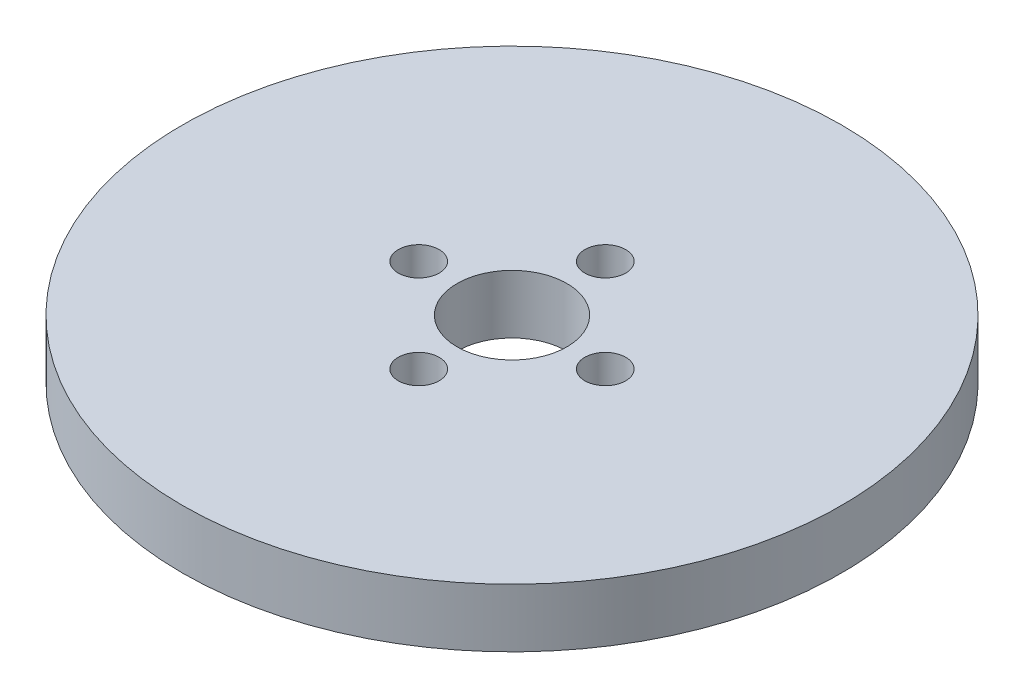
ISO-10303-21;
HEADER;
FILE_DESCRIPTION(('STEP AP214'),'2;1');
FILE_NAME('part.step','',(''),(''),'','','');
FILE_SCHEMA(('AUTOMOTIVE_DESIGN { 1 0 10303 214 1 1 1 1 }'));
ENDSEC;
DATA;
#1=APPLICATION_CONTEXT('core data for automotive mechanical design processes');
#2=APPLICATION_PROTOCOL_DEFINITION('international standard','automotive_design',2000,#1);
#3=PRODUCT_CONTEXT('',#1,'mechanical');
#4=PRODUCT('Part','Part','',(#3));
#5=PRODUCT_RELATED_PRODUCT_CATEGORY('part','',(#4));
#6=PRODUCT_DEFINITION_FORMATION('','',#4);
#7=PRODUCT_DEFINITION_CONTEXT('part definition',#1,'design');
#8=PRODUCT_DEFINITION('design','',#6,#7);
#9=PRODUCT_DEFINITION_SHAPE('','',#8);
#10=(LENGTH_UNIT() NAMED_UNIT(*) SI_UNIT(.MILLI.,.METRE.));
#11=(NAMED_UNIT(*) PLANE_ANGLE_UNIT() SI_UNIT($,.RADIAN.));
#12=(NAMED_UNIT(*) SI_UNIT($,.STERADIAN.) SOLID_ANGLE_UNIT());
#13=UNCERTAINTY_MEASURE_WITH_UNIT(LENGTH_MEASURE(1.E-05),#10,'distance_accuracy_value','');
#14=(GEOMETRIC_REPRESENTATION_CONTEXT(3) GLOBAL_UNCERTAINTY_ASSIGNED_CONTEXT((#13)) GLOBAL_UNIT_ASSIGNED_CONTEXT((#10,
#11,#12)) REPRESENTATION_CONTEXT('',''));
#15=CARTESIAN_POINT('',(0.,0.,0.));
#16=DIRECTION('',(0.,0.,1.));
#17=DIRECTION('',(1.,0.,0.));
#18=AXIS2_PLACEMENT_3D('',#15,#16,#17);
#19=CARTESIAN_POINT('',(0.,8.,0.));
#20=DIRECTION('',(0.,-1.,0.));
#21=DIRECTION('',(0.,0.,-1.));
#22=AXIS2_PLACEMENT_3D('',#19,#20,#21);
#23=CYLINDRICAL_SURFACE('',#22,45.);
#24=CARTESIAN_POINT('',(0.,8.,0.));
#25=DIRECTION('',(0.,1.,0.));
#26=DIRECTION('',(0.,0.,1.));
#27=AXIS2_PLACEMENT_3D('',#24,#25,#26);
#28=CIRCLE('',#27,45.);
#29=CARTESIAN_POINT('',(0.,8.,45.));
#30=VERTEX_POINT('',#29);
#31=EDGE_CURVE('E10',#30,#30,#28,.T.);
#32=ORIENTED_EDGE('',*,*,#31,.F.);
#33=EDGE_LOOP('',(#32));
#34=FACE_BOUND('',#33,.T.);
#35=CARTESIAN_POINT('',(0.,0.,0.));
#36=DIRECTION('',(0.,1.,0.));
#37=DIRECTION('',(0.,0.,1.));
#38=AXIS2_PLACEMENT_3D('',#35,#36,#37);
#39=CIRCLE('',#38,45.);
#40=CARTESIAN_POINT('',(0.,0.,45.));
#41=VERTEX_POINT('',#40);
#42=EDGE_CURVE('E37',#41,#41,#39,.T.);
#43=ORIENTED_EDGE('',*,*,#42,.T.);
#44=EDGE_LOOP('',(#43));
#45=FACE_BOUND('',#44,.T.);
#46=ADVANCED_FACE('F40',(#34,#45),#23,.T.);
#47=CARTESIAN_POINT('',(0.,8.,0.));
#48=DIRECTION('',(0.,1.,0.));
#49=DIRECTION('',(0.,0.,1.));
#50=AXIS2_PLACEMENT_3D('',#47,#48,#49);
#51=PLANE('',#50);
#52=CARTESIAN_POINT('',(0.,8.,12.7362660091459));
#53=DIRECTION('',(0.,1.,0.));
#54=DIRECTION('',(1.,0.,0.));
#55=AXIS2_PLACEMENT_3D('',#52,#53,#54);
#56=CIRCLE('',#55,2.78975216788166);
#57=CARTESIAN_POINT('',(0.,8.,15.5260181770275));
#58=VERTEX_POINT('',#57);
#59=EDGE_CURVE('E71',#58,#58,#56,.T.);
#60=ORIENTED_EDGE('',*,*,#59,.F.);
#61=EDGE_LOOP('',(#60));
#62=FACE_BOUND('',#61,.T.);
#63=CARTESIAN_POINT('',(12.7362660091459,8.,0.));
#64=DIRECTION('',(0.,1.,0.));
#65=DIRECTION('',(0.,0.,-1.));
#66=AXIS2_PLACEMENT_3D('',#63,#64,#65);
#67=CIRCLE('',#66,2.78975216788166);
#68=CARTESIAN_POINT('',(12.7362660091459,8.,2.78975216788166));
#69=VERTEX_POINT('',#68);
#70=EDGE_CURVE('E70',#69,#69,#67,.T.);
#71=ORIENTED_EDGE('',*,*,#70,.F.);
#72=EDGE_LOOP('',(#71));
#73=FACE_BOUND('',#72,.T.);
#74=CARTESIAN_POINT('',(-1.33405305292425E-13,8.,-12.7362660091459));
#75=DIRECTION('',(0.,1.,0.));
#76=DIRECTION('',(-1.,0.,0.));
#77=AXIS2_PLACEMENT_3D('',#74,#75,#76);
#78=CIRCLE('',#77,2.78975216788166);
#79=CARTESIAN_POINT('',(-1.33405305292425E-13,8.,-9.94651384126422));
#80=VERTEX_POINT('',#79);
#81=EDGE_CURVE('E61',#80,#80,#78,.T.);
#82=ORIENTED_EDGE('',*,*,#81,.F.);
#83=EDGE_LOOP('',(#82));
#84=FACE_BOUND('',#83,.T.);
#85=CARTESIAN_POINT('',(-12.7362660091459,8.,0.));
#86=DIRECTION('',(0.,1.,0.));
#87=DIRECTION('',(0.,0.,1.));
#88=AXIS2_PLACEMENT_3D('',#85,#86,#87);
#89=CIRCLE('',#88,2.78975216788166);
#90=CARTESIAN_POINT('',(-12.7362660091459,8.,2.78975216788166));
#91=VERTEX_POINT('',#90);
#92=EDGE_CURVE('E54',#91,#91,#89,.T.);
#93=ORIENTED_EDGE('',*,*,#92,.F.);
#94=EDGE_LOOP('',(#93));
#95=FACE_BOUND('',#94,.T.);
#96=CARTESIAN_POINT('',(0.,8.,0.));
#97=DIRECTION('',(0.,1.,0.));
#98=DIRECTION('',(0.,0.,1.));
#99=AXIS2_PLACEMENT_3D('',#96,#97,#98);
#100=CIRCLE('',#99,7.5);
#101=CARTESIAN_POINT('',(0.,8.,7.5));
#102=VERTEX_POINT('',#101);
#103=EDGE_CURVE('E50',#102,#102,#100,.T.);
#104=ORIENTED_EDGE('',*,*,#103,.F.);
#105=EDGE_LOOP('',(#104));
#106=FACE_BOUND('',#105,.T.);
#107=ORIENTED_EDGE('',*,*,#31,.T.);
#108=EDGE_LOOP('',(#107));
#109=FACE_BOUND('',#108,.T.);
#110=ADVANCED_FACE('F86',(#62,#73,#84,#95,#106,#109),#51,.T.);
#111=CARTESIAN_POINT('',(0.,0.,0.));
#112=DIRECTION('',(0.,1.,0.));
#113=DIRECTION('',(0.,0.,1.));
#114=AXIS2_PLACEMENT_3D('',#111,#112,#113);
#115=PLANE('',#114);
#116=CARTESIAN_POINT('',(0.,0.,0.));
#117=DIRECTION('',(0.,1.,0.));
#118=DIRECTION('',(0.,0.,1.));
#119=AXIS2_PLACEMENT_3D('',#116,#117,#118);
#120=CIRCLE('',#119,7.5);
#121=CARTESIAN_POINT('',(0.,0.,7.5));
#122=VERTEX_POINT('',#121);
#123=EDGE_CURVE('E47',#122,#122,#120,.T.);
#124=ORIENTED_EDGE('',*,*,#123,.T.);
#125=EDGE_LOOP('',(#124));
#126=FACE_BOUND('',#125,.T.);
#127=ORIENTED_EDGE('',*,*,#42,.F.);
#128=EDGE_LOOP('',(#127));
#129=FACE_BOUND('',#128,.T.);
#130=ADVANCED_FACE('F93',(#126,#129),#115,.F.);
#131=CARTESIAN_POINT('',(0.,8.,0.));
#132=DIRECTION('',(0.,-1.,0.));
#133=DIRECTION('',(0.,0.,-1.));
#134=AXIS2_PLACEMENT_3D('',#131,#132,#133);
#135=CYLINDRICAL_SURFACE('',#134,7.5);
#136=ORIENTED_EDGE('',*,*,#103,.T.);
#137=EDGE_LOOP('',(#136));
#138=FACE_BOUND('',#137,.T.);
#139=ORIENTED_EDGE('',*,*,#123,.F.);
#140=EDGE_LOOP('',(#139));
#141=FACE_BOUND('',#140,.T.);
#142=ADVANCED_FACE('F101',(#138,#141),#135,.F.);
#143=CARTESIAN_POINT('',(-12.7362660091459,2.96052295465424,0.));
#144=DIRECTION('',(0.,1.,0.));
#145=DIRECTION('',(0.,0.,1.));
#146=AXIS2_PLACEMENT_3D('',#143,#144,#145);
#147=CYLINDRICAL_SURFACE('',#146,2.78975216788166);
#148=CARTESIAN_POINT('',(-12.7362660091459,2.96052295465424,0.));
#149=DIRECTION('',(0.,1.,0.));
#150=DIRECTION('',(0.,0.,1.));
#151=AXIS2_PLACEMENT_3D('',#148,#149,#150);
#152=CIRCLE('',#151,2.78975216788166);
#153=CARTESIAN_POINT('',(-12.7362660091459,2.96052295465424,2.78975216788166));
#154=VERTEX_POINT('',#153);
#155=EDGE_CURVE('E55',#154,#154,#152,.T.);
#156=CARTESIAN_POINT('',(-12.7362660091459,2.96052295465424,2.78975216788166));
#157=CARTESIAN_POINT('',(-12.7362660091459,3.01301750720992,2.78975216788166));
#158=CARTESIAN_POINT('',(-12.7362660091459,3.06551205976561,2.78975216788166));
#159=CARTESIAN_POINT('',(-12.7362660091459,3.17050116487698,2.78975216788166));
#160=CARTESIAN_POINT('',(-12.7362660091459,3.22299571743266,2.78975216788166));
#161=CARTESIAN_POINT('',(-12.7362660091459,3.32798482254403,2.78975216788166));
#162=CARTESIAN_POINT('',(-12.7362660091459,3.38047937509972,2.78975216788166));
#163=CARTESIAN_POINT('',(-12.7362660091459,3.48546848021109,2.78975216788166));
#164=CARTESIAN_POINT('',(-12.7362660091459,3.53796303276677,2.78975216788166));
#165=CARTESIAN_POINT('',(-12.7362660091459,3.64295213787814,2.78975216788166));
#166=CARTESIAN_POINT('',(-12.7362660091459,3.69544669043383,2.78975216788166));
#167=CARTESIAN_POINT('',(-12.7362660091459,3.8004357955452,2.78975216788166));
#168=CARTESIAN_POINT('',(-12.7362660091459,3.85293034810088,2.78975216788166));
#169=CARTESIAN_POINT('',(-12.7362660091459,3.95791945321225,2.78975216788166));
#170=CARTESIAN_POINT('',(-12.7362660091459,4.01041400576794,2.78975216788166));
#171=CARTESIAN_POINT('',(-12.7362660091459,4.11540311087931,2.78975216788166));
#172=CARTESIAN_POINT('',(-12.7362660091459,4.16789766343499,2.78975216788166));
#173=CARTESIAN_POINT('',(-12.7362660091459,4.27288676854636,2.78975216788166));
#174=CARTESIAN_POINT('',(-12.7362660091459,4.32538132110205,2.78975216788166));
#175=CARTESIAN_POINT('',(-12.7362660091459,4.43037042621342,2.78975216788166));
#176=CARTESIAN_POINT('',(-12.7362660091459,4.4828649787691,2.78975216788166));
#177=CARTESIAN_POINT('',(-12.7362660091459,4.58785408388047,2.78975216788166));
#178=CARTESIAN_POINT('',(-12.7362660091459,4.64034863643616,2.78975216788166));
#179=CARTESIAN_POINT('',(-12.7362660091459,4.74533774154753,2.78975216788166));
#180=CARTESIAN_POINT('',(-12.7362660091459,4.79783229410321,2.78975216788166));
#181=CARTESIAN_POINT('',(-12.7362660091459,4.90282139921458,2.78975216788166));
#182=CARTESIAN_POINT('',(-12.7362660091459,4.95531595177027,2.78975216788166));
#183=CARTESIAN_POINT('',(-12.7362660091459,5.06030505688164,2.78975216788166));
#184=CARTESIAN_POINT('',(-12.7362660091459,5.11279960943732,2.78975216788166));
#185=CARTESIAN_POINT('',(-12.7362660091459,5.21778871454869,2.78975216788166));
#186=CARTESIAN_POINT('',(-12.7362660091459,5.27028326710438,2.78975216788166));
#187=CARTESIAN_POINT('',(-12.7362660091459,5.37527237221575,2.78975216788166));
#188=CARTESIAN_POINT('',(-12.7362660091459,5.42776692477143,2.78975216788166));
#189=CARTESIAN_POINT('',(-12.7362660091459,5.5327560298828,2.78975216788166));
#190=CARTESIAN_POINT('',(-12.7362660091459,5.58525058243849,2.78975216788166));
#191=CARTESIAN_POINT('',(-12.7362660091459,5.69023968754986,2.78975216788166));
#192=CARTESIAN_POINT('',(-12.7362660091459,5.74273424010554,2.78975216788166));
#193=CARTESIAN_POINT('',(-12.7362660091459,5.84772334521691,2.78975216788166));
#194=CARTESIAN_POINT('',(-12.7362660091459,5.9002178977726,2.78975216788166));
#195=CARTESIAN_POINT('',(-12.7362660091459,6.00520700288397,2.78975216788166));
#196=CARTESIAN_POINT('',(-12.7362660091459,6.05770155543965,2.78975216788166));
#197=CARTESIAN_POINT('',(-12.7362660091459,6.16269066055102,2.78975216788166));
#198=CARTESIAN_POINT('',(-12.7362660091459,6.21518521310671,2.78975216788166));
#199=CARTESIAN_POINT('',(-12.7362660091459,6.32017431821808,2.78975216788166));
#200=CARTESIAN_POINT('',(-12.7362660091459,6.37266887077376,2.78975216788166));
#201=CARTESIAN_POINT('',(-12.7362660091459,6.47765797588513,2.78975216788166));
#202=CARTESIAN_POINT('',(-12.7362660091459,6.53015252844082,2.78975216788166));
#203=CARTESIAN_POINT('',(-12.7362660091459,6.63514163355219,2.78975216788166));
#204=CARTESIAN_POINT('',(-12.7362660091459,6.68763618610787,2.78975216788166));
#205=CARTESIAN_POINT('',(-12.7362660091459,6.79262529121924,2.78975216788166));
#206=CARTESIAN_POINT('',(-12.7362660091459,6.84511984377493,2.78975216788166));
#207=CARTESIAN_POINT('',(-12.7362660091459,6.9501089488863,2.78975216788166));
#208=CARTESIAN_POINT('',(-12.7362660091459,7.00260350144198,2.78975216788166));
#209=CARTESIAN_POINT('',(-12.7362660091459,7.10759260655335,2.78975216788166));
#210=CARTESIAN_POINT('',(-12.7362660091459,7.16008715910904,2.78975216788166));
#211=CARTESIAN_POINT('',(-12.7362660091459,7.26507626422041,2.78975216788166));
#212=CARTESIAN_POINT('',(-12.7362660091459,7.31757081677609,2.78975216788166));
#213=CARTESIAN_POINT('',(-12.7362660091459,7.42255992188746,2.78975216788166));
#214=CARTESIAN_POINT('',(-12.7362660091459,7.47505447444315,2.78975216788166));
#215=CARTESIAN_POINT('',(-12.7362660091459,7.58004357955452,2.78975216788166));
#216=CARTESIAN_POINT('',(-12.7362660091459,7.6325381321102,2.78975216788166));
#217=CARTESIAN_POINT('',(-12.7362660091459,7.73752723722157,2.78975216788166));
#218=CARTESIAN_POINT('',(-12.7362660091459,7.79002178977726,2.78975216788166));
#219=CARTESIAN_POINT('',(-12.7362660091459,7.89501089488863,2.78975216788166));
#220=CARTESIAN_POINT('',(-12.7362660091459,7.94750544744431,2.78975216788166));
#221=CARTESIAN_POINT('',(-12.7362660091459,8.,2.78975216788166));
#222=B_SPLINE_CURVE_WITH_KNOTS('',3,(#156,#157,#158,#159,#160,#161,#162,#163,#164,#165,#166,
#167,#168,#169,#170,#171,#172,#173,#174,#175,#176,#177,#178,#179,#180,#181,#182,#183,#184,#185,
#186,#187,#188,#189,#190,#191,#192,#193,#194,#195,#196,#197,#198,#199,#200,#201,#202,#203,#204,
#205,#206,#207,#208,#209,#210,#211,#212,#213,#214,#215,#216,#217,#218,#219,#220,#221),
.UNSPECIFIED.,.F.,.F.,(4,2,2,2,2,2,2,2,2,2,2,2,2,2,2,2,2,2,2,2,2,2,2,2,2,2,2,2,2,2,2,2,4),(0.,
0.157483657667055,0.31496731533411,0.472450973001165,0.62993463066822,0.787418288335275,
0.94490194600233,1.10238560366939,1.25986926133644,1.4173529190035,1.57483657667055,
1.73232023433761,1.88980389200466,2.04728754967172,2.20477120733877,2.36225486500583,
2.51973852267288,2.67722218033994,2.83470583800699,2.99218949567405,3.1496731533411,
3.30715681100816,3.46464046867521,3.62212412634227,3.77960778400932,3.93709144167638,
4.09457509934343,4.25205875701049,4.40954241467754,4.5670260723446,4.72450973001165,
4.88199338767871,5.03947704534576),.UNSPECIFIED.);
#223=EDGE_CURVE('BSEAM102',#154,#91,#222,.T.);
#224=ORIENTED_EDGE('',*,*,#155,.F.);
#225=ORIENTED_EDGE('',*,*,#92,.T.);
#226=ORIENTED_EDGE('',*,*,#223,.T.);
#227=ORIENTED_EDGE('',*,*,#223,.F.);
#228=EDGE_LOOP('',(#224,#226,#225,#227));
#229=FACE_BOUND('',#228,.T.);
#230=ADVANCED_FACE('F102',(#229),#147,.F.);
#231=CARTESIAN_POINT('',(-12.7362660091459,2.96052295465424,0.));
#232=DIRECTION('',(0.,1.,0.));
#233=DIRECTION('',(0.,0.,1.));
#234=AXIS2_PLACEMENT_3D('',#231,#232,#233);
#235=PLANE('',#234);
#236=ORIENTED_EDGE('',*,*,#155,.T.);
#237=EDGE_LOOP('',(#236));
#238=FACE_BOUND('',#237,.T.);
#239=ADVANCED_FACE('F133',(#238),#235,.T.);
#240=CARTESIAN_POINT('',(-1.33405305292425E-13,2.96052295465424,-12.7362660091459));
#241=DIRECTION('',(0.,1.,0.));
#242=DIRECTION('',(0.,0.,1.));
#243=AXIS2_PLACEMENT_3D('',#240,#241,#242);
#244=CYLINDRICAL_SURFACE('',#243,2.78975216788166);
#245=CARTESIAN_POINT('',(-1.33405305292425E-13,2.96052295465424,-12.7362660091459));
#246=DIRECTION('',(0.,1.,0.));
#247=DIRECTION('',(-1.,0.,0.));
#248=AXIS2_PLACEMENT_3D('',#245,#246,#247);
#249=CIRCLE('',#248,2.78975216788166);
#250=CARTESIAN_POINT('',(-1.33405305292425E-13,2.96052295465424,-9.94651384126422));
#251=VERTEX_POINT('',#250);
#252=EDGE_CURVE('E63',#251,#251,#249,.T.);
#253=CARTESIAN_POINT('',(-1.33405305292425E-13,2.96052295465424,-9.94651384126422));
#254=CARTESIAN_POINT('',(-1.33405305292425E-13,3.01301750720992,-9.94651384126422));
#255=CARTESIAN_POINT('',(-1.33405305292425E-13,3.06551205976561,-9.94651384126422));
#256=CARTESIAN_POINT('',(-1.33405305292425E-13,3.17050116487698,-9.94651384126422));
#257=CARTESIAN_POINT('',(-1.33405305292425E-13,3.22299571743266,-9.94651384126422));
#258=CARTESIAN_POINT('',(-1.33405305292425E-13,3.32798482254403,-9.94651384126422));
#259=CARTESIAN_POINT('',(-1.33405305292425E-13,3.38047937509972,-9.94651384126422));
#260=CARTESIAN_POINT('',(-1.33405305292425E-13,3.48546848021109,-9.94651384126422));
#261=CARTESIAN_POINT('',(-1.33405305292425E-13,3.53796303276677,-9.94651384126422));
#262=CARTESIAN_POINT('',(-1.33405305292425E-13,3.64295213787814,-9.94651384126422));
#263=CARTESIAN_POINT('',(-1.33405305292425E-13,3.69544669043383,-9.94651384126422));
#264=CARTESIAN_POINT('',(-1.33405305292425E-13,3.8004357955452,-9.94651384126422));
#265=CARTESIAN_POINT('',(-1.33405305292425E-13,3.85293034810088,-9.94651384126422));
#266=CARTESIAN_POINT('',(-1.33405305292425E-13,3.95791945321225,-9.94651384126422));
#267=CARTESIAN_POINT('',(-1.33405305292425E-13,4.01041400576794,-9.94651384126422));
#268=CARTESIAN_POINT('',(-1.33405305292425E-13,4.11540311087931,-9.94651384126422));
#269=CARTESIAN_POINT('',(-1.33405305292425E-13,4.16789766343499,-9.94651384126422));
#270=CARTESIAN_POINT('',(-1.33405305292425E-13,4.27288676854636,-9.94651384126422));
#271=CARTESIAN_POINT('',(-1.33405305292425E-13,4.32538132110205,-9.94651384126422));
#272=CARTESIAN_POINT('',(-1.33405305292425E-13,4.43037042621342,-9.94651384126422));
#273=CARTESIAN_POINT('',(-1.33405305292425E-13,4.4828649787691,-9.94651384126422));
#274=CARTESIAN_POINT('',(-1.33405305292425E-13,4.58785408388047,-9.94651384126422));
#275=CARTESIAN_POINT('',(-1.33405305292425E-13,4.64034863643616,-9.94651384126422));
#276=CARTESIAN_POINT('',(-1.33405305292425E-13,4.74533774154753,-9.94651384126422));
#277=CARTESIAN_POINT('',(-1.33405305292425E-13,4.79783229410321,-9.94651384126422));
#278=CARTESIAN_POINT('',(-1.33405305292425E-13,4.90282139921458,-9.94651384126422));
#279=CARTESIAN_POINT('',(-1.33405305292425E-13,4.95531595177027,-9.94651384126422));
#280=CARTESIAN_POINT('',(-1.33405305292425E-13,5.06030505688164,-9.94651384126422));
#281=CARTESIAN_POINT('',(-1.33405305292425E-13,5.11279960943732,-9.94651384126422));
#282=CARTESIAN_POINT('',(-1.33405305292425E-13,5.21778871454869,-9.94651384126422));
#283=CARTESIAN_POINT('',(-1.33405305292425E-13,5.27028326710438,-9.94651384126422));
#284=CARTESIAN_POINT('',(-1.33405305292425E-13,5.37527237221575,-9.94651384126422));
#285=CARTESIAN_POINT('',(-1.33405305292425E-13,5.42776692477143,-9.94651384126422));
#286=CARTESIAN_POINT('',(-1.33405305292425E-13,5.5327560298828,-9.94651384126422));
#287=CARTESIAN_POINT('',(-1.33405305292425E-13,5.58525058243849,-9.94651384126422));
#288=CARTESIAN_POINT('',(-1.33405305292425E-13,5.69023968754986,-9.94651384126422));
#289=CARTESIAN_POINT('',(-1.33405305292425E-13,5.74273424010554,-9.94651384126422));
#290=CARTESIAN_POINT('',(-1.33405305292425E-13,5.84772334521691,-9.94651384126422));
#291=CARTESIAN_POINT('',(-1.33405305292425E-13,5.9002178977726,-9.94651384126422));
#292=CARTESIAN_POINT('',(-1.33405305292425E-13,6.00520700288397,-9.94651384126422));
#293=CARTESIAN_POINT('',(-1.33405305292425E-13,6.05770155543965,-9.94651384126422));
#294=CARTESIAN_POINT('',(-1.33405305292425E-13,6.16269066055102,-9.94651384126422));
#295=CARTESIAN_POINT('',(-1.33405305292425E-13,6.21518521310671,-9.94651384126422));
#296=CARTESIAN_POINT('',(-1.33405305292425E-13,6.32017431821808,-9.94651384126422));
#297=CARTESIAN_POINT('',(-1.33405305292425E-13,6.37266887077376,-9.94651384126422));
#298=CARTESIAN_POINT('',(-1.33405305292425E-13,6.47765797588513,-9.94651384126422));
#299=CARTESIAN_POINT('',(-1.33405305292425E-13,6.53015252844082,-9.94651384126422));
#300=CARTESIAN_POINT('',(-1.33405305292425E-13,6.63514163355219,-9.94651384126422));
#301=CARTESIAN_POINT('',(-1.33405305292425E-13,6.68763618610787,-9.94651384126422));
#302=CARTESIAN_POINT('',(-1.33405305292425E-13,6.79262529121924,-9.94651384126422));
#303=CARTESIAN_POINT('',(-1.33405305292425E-13,6.84511984377493,-9.94651384126422));
#304=CARTESIAN_POINT('',(-1.33405305292425E-13,6.9501089488863,-9.94651384126422));
#305=CARTESIAN_POINT('',(-1.33405305292425E-13,7.00260350144198,-9.94651384126422));
#306=CARTESIAN_POINT('',(-1.33405305292425E-13,7.10759260655335,-9.94651384126422));
#307=CARTESIAN_POINT('',(-1.33405305292425E-13,7.16008715910904,-9.94651384126422));
#308=CARTESIAN_POINT('',(-1.33405305292425E-13,7.26507626422041,-9.94651384126422));
#309=CARTESIAN_POINT('',(-1.33405305292425E-13,7.31757081677609,-9.94651384126422));
#310=CARTESIAN_POINT('',(-1.33405305292425E-13,7.42255992188746,-9.94651384126422));
#311=CARTESIAN_POINT('',(-1.33405305292425E-13,7.47505447444315,-9.94651384126422));
#312=CARTESIAN_POINT('',(-1.33405305292425E-13,7.58004357955452,-9.94651384126422));
#313=CARTESIAN_POINT('',(-1.33405305292425E-13,7.6325381321102,-9.94651384126422));
#314=CARTESIAN_POINT('',(-1.33405305292425E-13,7.73752723722157,-9.94651384126422));
#315=CARTESIAN_POINT('',(-1.33405305292425E-13,7.79002178977726,-9.94651384126422));
#316=CARTESIAN_POINT('',(-1.33405305292425E-13,7.89501089488863,-9.94651384126422));
#317=CARTESIAN_POINT('',(-1.33405305292425E-13,7.94750544744431,-9.94651384126422));
#318=CARTESIAN_POINT('',(-1.33405305292425E-13,8.,-9.94651384126422));
#319=B_SPLINE_CURVE_WITH_KNOTS('',3,(#253,#254,#255,#256,#257,#258,#259,#260,#261,#262,#263,
#264,#265,#266,#267,#268,#269,#270,#271,#272,#273,#274,#275,#276,#277,#278,#279,#280,#281,#282,
#283,#284,#285,#286,#287,#288,#289,#290,#291,#292,#293,#294,#295,#296,#297,#298,#299,#300,#301,
#302,#303,#304,#305,#306,#307,#308,#309,#310,#311,#312,#313,#314,#315,#316,#317,#318),
.UNSPECIFIED.,.F.,.F.,(4,2,2,2,2,2,2,2,2,2,2,2,2,2,2,2,2,2,2,2,2,2,2,2,2,2,2,2,2,2,2,2,4),(0.,
0.157483657667055,0.31496731533411,0.472450973001165,0.62993463066822,0.787418288335275,
0.94490194600233,1.10238560366939,1.25986926133644,1.4173529190035,1.57483657667055,
1.73232023433761,1.88980389200466,2.04728754967172,2.20477120733877,2.36225486500583,
2.51973852267288,2.67722218033994,2.83470583800699,2.99218949567405,3.1496731533411,
3.30715681100816,3.46464046867521,3.62212412634227,3.77960778400932,3.93709144167638,
4.09457509934343,4.25205875701049,4.40954241467754,4.5670260723446,4.72450973001165,
4.88199338767871,5.03947704534576),.UNSPECIFIED.);
#320=EDGE_CURVE('BSEAM142',#251,#80,#319,.T.);
#321=ORIENTED_EDGE('',*,*,#252,.F.);
#322=ORIENTED_EDGE('',*,*,#81,.T.);
#323=ORIENTED_EDGE('',*,*,#320,.T.);
#324=ORIENTED_EDGE('',*,*,#320,.F.);
#325=EDGE_LOOP('',(#321,#323,#322,#324));
#326=FACE_BOUND('',#325,.T.);
#327=ADVANCED_FACE('F142',(#326),#244,.F.);
#328=CARTESIAN_POINT('',(-1.33405305292425E-13,2.96052295465424,-12.7362660091459));
#329=DIRECTION('',(0.,1.,0.));
#330=DIRECTION('',(-1.,0.,0.));
#331=AXIS2_PLACEMENT_3D('',#328,#329,#330);
#332=PLANE('',#331);
#333=ORIENTED_EDGE('',*,*,#252,.T.);
#334=EDGE_LOOP('',(#333));
#335=FACE_BOUND('',#334,.T.);
#336=ADVANCED_FACE('F156',(#335),#332,.T.);
#337=CARTESIAN_POINT('',(12.7362660091459,2.96052295465424,0.));
#338=DIRECTION('',(0.,1.,0.));
#339=DIRECTION('',(0.,0.,1.));
#340=AXIS2_PLACEMENT_3D('',#337,#338,#339);
#341=CYLINDRICAL_SURFACE('',#340,2.78975216788166);
#342=CARTESIAN_POINT('',(12.7362660091459,2.96052295465424,0.));
#343=DIRECTION('',(0.,1.,0.));
#344=DIRECTION('',(0.,0.,-1.));
#345=AXIS2_PLACEMENT_3D('',#342,#343,#344);
#346=CIRCLE('',#345,2.78975216788166);
#347=CARTESIAN_POINT('',(12.7362660091459,2.96052295465424,2.78975216788166));
#348=VERTEX_POINT('',#347);
#349=EDGE_CURVE('E69',#348,#348,#346,.T.);
#350=CARTESIAN_POINT('',(12.7362660091459,2.96052295465424,2.78975216788166));
#351=CARTESIAN_POINT('',(12.7362660091459,3.01301750720992,2.78975216788166));
#352=CARTESIAN_POINT('',(12.7362660091459,3.06551205976561,2.78975216788166));
#353=CARTESIAN_POINT('',(12.7362660091459,3.17050116487698,2.78975216788166));
#354=CARTESIAN_POINT('',(12.7362660091459,3.22299571743266,2.78975216788166));
#355=CARTESIAN_POINT('',(12.7362660091459,3.32798482254403,2.78975216788166));
#356=CARTESIAN_POINT('',(12.7362660091459,3.38047937509972,2.78975216788166));
#357=CARTESIAN_POINT('',(12.7362660091459,3.48546848021109,2.78975216788166));
#358=CARTESIAN_POINT('',(12.7362660091459,3.53796303276677,2.78975216788166));
#359=CARTESIAN_POINT('',(12.7362660091459,3.64295213787814,2.78975216788166));
#360=CARTESIAN_POINT('',(12.7362660091459,3.69544669043383,2.78975216788166));
#361=CARTESIAN_POINT('',(12.7362660091459,3.8004357955452,2.78975216788166));
#362=CARTESIAN_POINT('',(12.7362660091459,3.85293034810088,2.78975216788166));
#363=CARTESIAN_POINT('',(12.7362660091459,3.95791945321225,2.78975216788166));
#364=CARTESIAN_POINT('',(12.7362660091459,4.01041400576794,2.78975216788166));
#365=CARTESIAN_POINT('',(12.7362660091459,4.11540311087931,2.78975216788166));
#366=CARTESIAN_POINT('',(12.7362660091459,4.16789766343499,2.78975216788166));
#367=CARTESIAN_POINT('',(12.7362660091459,4.27288676854636,2.78975216788166));
#368=CARTESIAN_POINT('',(12.7362660091459,4.32538132110205,2.78975216788166));
#369=CARTESIAN_POINT('',(12.7362660091459,4.43037042621342,2.78975216788166));
#370=CARTESIAN_POINT('',(12.7362660091459,4.4828649787691,2.78975216788166));
#371=CARTESIAN_POINT('',(12.7362660091459,4.58785408388047,2.78975216788166));
#372=CARTESIAN_POINT('',(12.7362660091459,4.64034863643616,2.78975216788166));
#373=CARTESIAN_POINT('',(12.7362660091459,4.74533774154753,2.78975216788166));
#374=CARTESIAN_POINT('',(12.7362660091459,4.79783229410321,2.78975216788166));
#375=CARTESIAN_POINT('',(12.7362660091459,4.90282139921458,2.78975216788166));
#376=CARTESIAN_POINT('',(12.7362660091459,4.95531595177027,2.78975216788166));
#377=CARTESIAN_POINT('',(12.7362660091459,5.06030505688164,2.78975216788166));
#378=CARTESIAN_POINT('',(12.7362660091459,5.11279960943732,2.78975216788166));
#379=CARTESIAN_POINT('',(12.7362660091459,5.21778871454869,2.78975216788166));
#380=CARTESIAN_POINT('',(12.7362660091459,5.27028326710438,2.78975216788166));
#381=CARTESIAN_POINT('',(12.7362660091459,5.37527237221575,2.78975216788166));
#382=CARTESIAN_POINT('',(12.7362660091459,5.42776692477143,2.78975216788166));
#383=CARTESIAN_POINT('',(12.7362660091459,5.5327560298828,2.78975216788166));
#384=CARTESIAN_POINT('',(12.7362660091459,5.58525058243849,2.78975216788166));
#385=CARTESIAN_POINT('',(12.7362660091459,5.69023968754986,2.78975216788166));
#386=CARTESIAN_POINT('',(12.7362660091459,5.74273424010554,2.78975216788166));
#387=CARTESIAN_POINT('',(12.7362660091459,5.84772334521691,2.78975216788166));
#388=CARTESIAN_POINT('',(12.7362660091459,5.9002178977726,2.78975216788166));
#389=CARTESIAN_POINT('',(12.7362660091459,6.00520700288397,2.78975216788166));
#390=CARTESIAN_POINT('',(12.7362660091459,6.05770155543965,2.78975216788166));
#391=CARTESIAN_POINT('',(12.7362660091459,6.16269066055102,2.78975216788166));
#392=CARTESIAN_POINT('',(12.7362660091459,6.21518521310671,2.78975216788166));
#393=CARTESIAN_POINT('',(12.7362660091459,6.32017431821808,2.78975216788166));
#394=CARTESIAN_POINT('',(12.7362660091459,6.37266887077376,2.78975216788166));
#395=CARTESIAN_POINT('',(12.7362660091459,6.47765797588513,2.78975216788166));
#396=CARTESIAN_POINT('',(12.7362660091459,6.53015252844082,2.78975216788166));
#397=CARTESIAN_POINT('',(12.7362660091459,6.63514163355219,2.78975216788166));
#398=CARTESIAN_POINT('',(12.7362660091459,6.68763618610787,2.78975216788166));
#399=CARTESIAN_POINT('',(12.7362660091459,6.79262529121924,2.78975216788166));
#400=CARTESIAN_POINT('',(12.7362660091459,6.84511984377493,2.78975216788166));
#401=CARTESIAN_POINT('',(12.7362660091459,6.9501089488863,2.78975216788166));
#402=CARTESIAN_POINT('',(12.7362660091459,7.00260350144198,2.78975216788166));
#403=CARTESIAN_POINT('',(12.7362660091459,7.10759260655335,2.78975216788166));
#404=CARTESIAN_POINT('',(12.7362660091459,7.16008715910904,2.78975216788166));
#405=CARTESIAN_POINT('',(12.7362660091459,7.26507626422041,2.78975216788166));
#406=CARTESIAN_POINT('',(12.7362660091459,7.31757081677609,2.78975216788166));
#407=CARTESIAN_POINT('',(12.7362660091459,7.42255992188746,2.78975216788166));
#408=CARTESIAN_POINT('',(12.7362660091459,7.47505447444315,2.78975216788166));
#409=CARTESIAN_POINT('',(12.7362660091459,7.58004357955452,2.78975216788166));
#410=CARTESIAN_POINT('',(12.7362660091459,7.6325381321102,2.78975216788166));
#411=CARTESIAN_POINT('',(12.7362660091459,7.73752723722157,2.78975216788166));
#412=CARTESIAN_POINT('',(12.7362660091459,7.79002178977726,2.78975216788166));
#413=CARTESIAN_POINT('',(12.7362660091459,7.89501089488863,2.78975216788166));
#414=CARTESIAN_POINT('',(12.7362660091459,7.94750544744431,2.78975216788166));
#415=CARTESIAN_POINT('',(12.7362660091459,8.,2.78975216788166));
#416=B_SPLINE_CURVE_WITH_KNOTS('',3,(#350,#351,#352,#353,#354,#355,#356,#357,#358,#359,#360,
#361,#362,#363,#364,#365,#366,#367,#368,#369,#370,#371,#372,#373,#374,#375,#376,#377,#378,#379,
#380,#381,#382,#383,#384,#385,#386,#387,#388,#389,#390,#391,#392,#393,#394,#395,#396,#397,#398,
#399,#400,#401,#402,#403,#404,#405,#406,#407,#408,#409,#410,#411,#412,#413,#414,#415),
.UNSPECIFIED.,.F.,.F.,(4,2,2,2,2,2,2,2,2,2,2,2,2,2,2,2,2,2,2,2,2,2,2,2,2,2,2,2,2,2,2,2,4),(0.,
0.157483657667055,0.31496731533411,0.472450973001165,0.62993463066822,0.787418288335275,
0.94490194600233,1.10238560366939,1.25986926133644,1.4173529190035,1.57483657667055,
1.73232023433761,1.88980389200466,2.04728754967172,2.20477120733877,2.36225486500583,
2.51973852267288,2.67722218033994,2.83470583800699,2.99218949567405,3.1496731533411,
3.30715681100816,3.46464046867521,3.62212412634227,3.77960778400932,3.93709144167638,
4.09457509934343,4.25205875701049,4.40954241467754,4.5670260723446,4.72450973001165,
4.88199338767871,5.03947704534576),.UNSPECIFIED.);
#417=EDGE_CURVE('BSEAM164',#348,#69,#416,.T.);
#418=ORIENTED_EDGE('',*,*,#349,.F.);
#419=ORIENTED_EDGE('',*,*,#70,.T.);
#420=ORIENTED_EDGE('',*,*,#417,.T.);
#421=ORIENTED_EDGE('',*,*,#417,.F.);
#422=EDGE_LOOP('',(#418,#420,#419,#421));
#423=FACE_BOUND('',#422,.T.);
#424=ADVANCED_FACE('F164',(#423),#341,.F.);
#425=CARTESIAN_POINT('',(12.7362660091459,2.96052295465424,0.));
#426=DIRECTION('',(0.,1.,0.));
#427=DIRECTION('',(0.,0.,-1.));
#428=AXIS2_PLACEMENT_3D('',#425,#426,#427);
#429=PLANE('',#428);
#430=ORIENTED_EDGE('',*,*,#349,.T.);
#431=EDGE_LOOP('',(#430));
#432=FACE_BOUND('',#431,.T.);
#433=ADVANCED_FACE('F83',(#432),#429,.T.);
#434=CARTESIAN_POINT('',(0.,2.96052295465424,12.7362660091459));
#435=DIRECTION('',(0.,1.,0.));
#436=DIRECTION('',(0.,0.,1.));
#437=AXIS2_PLACEMENT_3D('',#434,#435,#436);
#438=CYLINDRICAL_SURFACE('',#437,2.78975216788166);
#439=CARTESIAN_POINT('',(0.,2.96052295465424,12.7362660091459));
#440=DIRECTION('',(0.,1.,0.));
#441=DIRECTION('',(1.,0.,0.));
#442=AXIS2_PLACEMENT_3D('',#439,#440,#441);
#443=CIRCLE('',#442,2.78975216788166);
#444=CARTESIAN_POINT('',(0.,2.96052295465424,15.5260181770275));
#445=VERTEX_POINT('',#444);
#446=EDGE_CURVE('E59',#445,#445,#443,.T.);
#447=CARTESIAN_POINT('',(0.,2.96052295465424,15.5260181770275));
#448=CARTESIAN_POINT('',(0.,3.01301750720992,15.5260181770275));
#449=CARTESIAN_POINT('',(0.,3.06551205976561,15.5260181770275));
#450=CARTESIAN_POINT('',(0.,3.17050116487698,15.5260181770275));
#451=CARTESIAN_POINT('',(0.,3.22299571743266,15.5260181770275));
#452=CARTESIAN_POINT('',(0.,3.32798482254403,15.5260181770275));
#453=CARTESIAN_POINT('',(0.,3.38047937509972,15.5260181770275));
#454=CARTESIAN_POINT('',(0.,3.48546848021109,15.5260181770275));
#455=CARTESIAN_POINT('',(0.,3.53796303276677,15.5260181770275));
#456=CARTESIAN_POINT('',(0.,3.64295213787814,15.5260181770275));
#457=CARTESIAN_POINT('',(0.,3.69544669043383,15.5260181770275));
#458=CARTESIAN_POINT('',(0.,3.8004357955452,15.5260181770275));
#459=CARTESIAN_POINT('',(0.,3.85293034810088,15.5260181770275));
#460=CARTESIAN_POINT('',(0.,3.95791945321225,15.5260181770275));
#461=CARTESIAN_POINT('',(0.,4.01041400576794,15.5260181770275));
#462=CARTESIAN_POINT('',(0.,4.11540311087931,15.5260181770275));
#463=CARTESIAN_POINT('',(0.,4.16789766343499,15.5260181770275));
#464=CARTESIAN_POINT('',(0.,4.27288676854636,15.5260181770275));
#465=CARTESIAN_POINT('',(0.,4.32538132110205,15.5260181770275));
#466=CARTESIAN_POINT('',(0.,4.43037042621342,15.5260181770275));
#467=CARTESIAN_POINT('',(0.,4.4828649787691,15.5260181770275));
#468=CARTESIAN_POINT('',(0.,4.58785408388047,15.5260181770275));
#469=CARTESIAN_POINT('',(0.,4.64034863643616,15.5260181770275));
#470=CARTESIAN_POINT('',(0.,4.74533774154753,15.5260181770275));
#471=CARTESIAN_POINT('',(0.,4.79783229410321,15.5260181770275));
#472=CARTESIAN_POINT('',(0.,4.90282139921458,15.5260181770275));
#473=CARTESIAN_POINT('',(0.,4.95531595177027,15.5260181770275));
#474=CARTESIAN_POINT('',(0.,5.06030505688164,15.5260181770275));
#475=CARTESIAN_POINT('',(0.,5.11279960943732,15.5260181770275));
#476=CARTESIAN_POINT('',(0.,5.21778871454869,15.5260181770275));
#477=CARTESIAN_POINT('',(0.,5.27028326710438,15.5260181770275));
#478=CARTESIAN_POINT('',(0.,5.37527237221575,15.5260181770275));
#479=CARTESIAN_POINT('',(0.,5.42776692477143,15.5260181770275));
#480=CARTESIAN_POINT('',(0.,5.5327560298828,15.5260181770275));
#481=CARTESIAN_POINT('',(0.,5.58525058243849,15.5260181770275));
#482=CARTESIAN_POINT('',(0.,5.69023968754986,15.5260181770275));
#483=CARTESIAN_POINT('',(0.,5.74273424010554,15.5260181770275));
#484=CARTESIAN_POINT('',(0.,5.84772334521691,15.5260181770275));
#485=CARTESIAN_POINT('',(0.,5.9002178977726,15.5260181770275));
#486=CARTESIAN_POINT('',(0.,6.00520700288397,15.5260181770275));
#487=CARTESIAN_POINT('',(0.,6.05770155543965,15.5260181770275));
#488=CARTESIAN_POINT('',(0.,6.16269066055102,15.5260181770275));
#489=CARTESIAN_POINT('',(0.,6.21518521310671,15.5260181770275));
#490=CARTESIAN_POINT('',(0.,6.32017431821808,15.5260181770275));
#491=CARTESIAN_POINT('',(0.,6.37266887077376,15.5260181770275));
#492=CARTESIAN_POINT('',(0.,6.47765797588513,15.5260181770275));
#493=CARTESIAN_POINT('',(0.,6.53015252844082,15.5260181770275));
#494=CARTESIAN_POINT('',(0.,6.63514163355219,15.5260181770275));
#495=CARTESIAN_POINT('',(0.,6.68763618610787,15.5260181770275));
#496=CARTESIAN_POINT('',(0.,6.79262529121924,15.5260181770275));
#497=CARTESIAN_POINT('',(0.,6.84511984377493,15.5260181770275));
#498=CARTESIAN_POINT('',(0.,6.9501089488863,15.5260181770275));
#499=CARTESIAN_POINT('',(0.,7.00260350144198,15.5260181770275));
#500=CARTESIAN_POINT('',(0.,7.10759260655335,15.5260181770275));
#501=CARTESIAN_POINT('',(0.,7.16008715910904,15.5260181770275));
#502=CARTESIAN_POINT('',(0.,7.26507626422041,15.5260181770275));
#503=CARTESIAN_POINT('',(0.,7.31757081677609,15.5260181770275));
#504=CARTESIAN_POINT('',(0.,7.42255992188746,15.5260181770275));
#505=CARTESIAN_POINT('',(0.,7.47505447444315,15.5260181770275));
#506=CARTESIAN_POINT('',(0.,7.58004357955452,15.5260181770275));
#507=CARTESIAN_POINT('',(0.,7.6325381321102,15.5260181770275));
#508=CARTESIAN_POINT('',(0.,7.73752723722157,15.5260181770275));
#509=CARTESIAN_POINT('',(0.,7.79002178977726,15.5260181770275));
#510=CARTESIAN_POINT('',(0.,7.89501089488863,15.5260181770275));
#511=CARTESIAN_POINT('',(0.,7.94750544744431,15.5260181770275));
#512=CARTESIAN_POINT('',(0.,8.,15.5260181770275));
#513=B_SPLINE_CURVE_WITH_KNOTS('',3,(#447,#448,#449,#450,#451,#452,#453,#454,#455,#456,#457,
#458,#459,#460,#461,#462,#463,#464,#465,#466,#467,#468,#469,#470,#471,#472,#473,#474,#475,#476,
#477,#478,#479,#480,#481,#482,#483,#484,#485,#486,#487,#488,#489,#490,#491,#492,#493,#494,#495,
#496,#497,#498,#499,#500,#501,#502,#503,#504,#505,#506,#507,#508,#509,#510,#511,#512),
.UNSPECIFIED.,.F.,.F.,(4,2,2,2,2,2,2,2,2,2,2,2,2,2,2,2,2,2,2,2,2,2,2,2,2,2,2,2,2,2,2,2,4),(0.,
0.157483657667055,0.31496731533411,0.472450973001165,0.62993463066822,0.787418288335275,
0.94490194600233,1.10238560366939,1.25986926133644,1.4173529190035,1.57483657667055,
1.73232023433761,1.88980389200466,2.04728754967172,2.20477120733877,2.36225486500583,
2.51973852267288,2.67722218033994,2.83470583800699,2.99218949567405,3.1496731533411,
3.30715681100816,3.46464046867521,3.62212412634227,3.77960778400932,3.93709144167638,
4.09457509934343,4.25205875701049,4.40954241467754,4.5670260723446,4.72450973001165,
4.88199338767871,5.03947704534576),.UNSPECIFIED.);
#514=EDGE_CURVE('BSEAM81',#445,#58,#513,.T.);
#515=ORIENTED_EDGE('',*,*,#446,.F.);
#516=ORIENTED_EDGE('',*,*,#59,.T.);
#517=ORIENTED_EDGE('',*,*,#514,.T.);
#518=ORIENTED_EDGE('',*,*,#514,.F.);
#519=EDGE_LOOP('',(#515,#517,#516,#518));
#520=FACE_BOUND('',#519,.T.);
#521=ADVANCED_FACE('F81',(#520),#438,.F.);
#522=CARTESIAN_POINT('',(0.,2.96052295465424,12.7362660091459));
#523=DIRECTION('',(0.,1.,0.));
#524=DIRECTION('',(1.,0.,0.));
#525=AXIS2_PLACEMENT_3D('',#522,#523,#524);
#526=PLANE('',#525);
#527=ORIENTED_EDGE('',*,*,#446,.T.);
#528=EDGE_LOOP('',(#527));
#529=FACE_BOUND('',#528,.T.);
#530=ADVANCED_FACE('F78',(#529),#526,.T.);
#531=CLOSED_SHELL('',(#46,#110,#130,#142,#230,#239,#327,#336,#424,#433,#521,#530));
#532=MANIFOLD_SOLID_BREP('B2',#531);
#533=ADVANCED_BREP_SHAPE_REPRESENTATION('',(#18,#532),#14);
#534=SHAPE_DEFINITION_REPRESENTATION(#9,#533);
ENDSEC;
END-ISO-10303-21;
